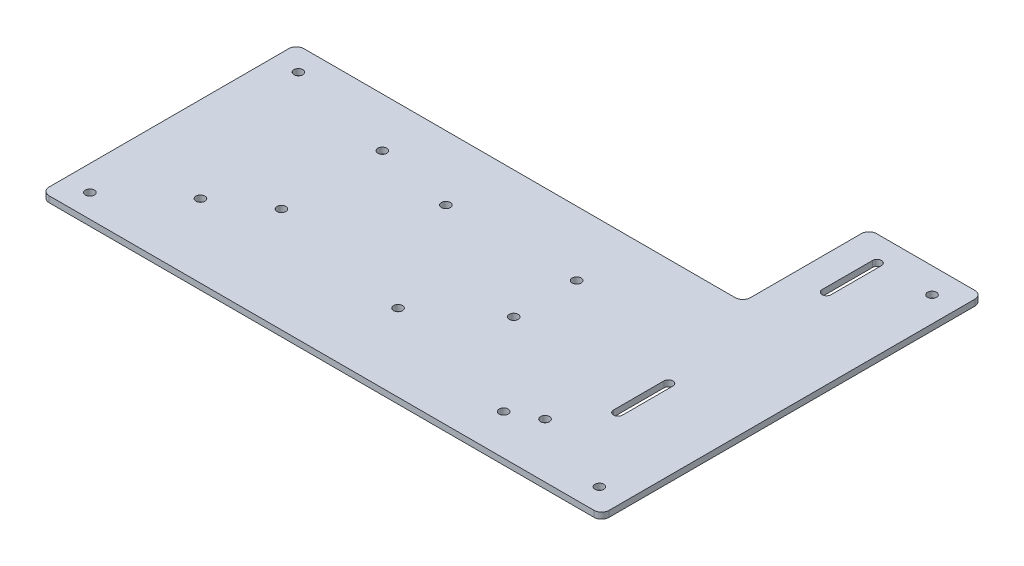
ISO-10303-21;
HEADER;
FILE_DESCRIPTION(('STEP AP214'),'2;1');
FILE_NAME('part.step','',(''),(''),'','','');
FILE_SCHEMA(('AUTOMOTIVE_DESIGN { 1 0 10303 214 1 1 1 1 }'));
ENDSEC;
DATA;
#1=APPLICATION_CONTEXT('core data for automotive mechanical design processes');
#2=APPLICATION_PROTOCOL_DEFINITION('international standard','automotive_design',2000,#1);
#3=PRODUCT_CONTEXT('',#1,'mechanical');
#4=PRODUCT('Part','Part','',(#3));
#5=PRODUCT_RELATED_PRODUCT_CATEGORY('part','',(#4));
#6=PRODUCT_DEFINITION_FORMATION('','',#4);
#7=PRODUCT_DEFINITION_CONTEXT('part definition',#1,'design');
#8=PRODUCT_DEFINITION('design','',#6,#7);
#9=PRODUCT_DEFINITION_SHAPE('','',#8);
#10=(LENGTH_UNIT() NAMED_UNIT(*) SI_UNIT(.MILLI.,.METRE.));
#11=(NAMED_UNIT(*) PLANE_ANGLE_UNIT() SI_UNIT($,.RADIAN.));
#12=(NAMED_UNIT(*) SI_UNIT($,.STERADIAN.) SOLID_ANGLE_UNIT());
#13=UNCERTAINTY_MEASURE_WITH_UNIT(LENGTH_MEASURE(1.E-05),#10,'distance_accuracy_value','');
#14=(GEOMETRIC_REPRESENTATION_CONTEXT(3) GLOBAL_UNCERTAINTY_ASSIGNED_CONTEXT((#13)) GLOBAL_UNIT_ASSIGNED_CONTEXT((#10,
#11,#12)) REPRESENTATION_CONTEXT('',''));
#15=CARTESIAN_POINT('',(0.,0.,0.));
#16=DIRECTION('',(0.,0.,1.));
#17=DIRECTION('',(1.,0.,0.));
#18=AXIS2_PLACEMENT_3D('',#15,#16,#17);
#19=CARTESIAN_POINT('',(0.,0.,0.));
#20=DIRECTION('',(0.,-1.,0.));
#21=DIRECTION('',(0.,0.,-1.));
#22=AXIS2_PLACEMENT_3D('',#19,#20,#21);
#23=PLANE('',#22);
#24=CARTESIAN_POINT('',(241.554,0.,-48.67));
#25=DIRECTION('',(0.,1.,0.));
#26=DIRECTION('',(0.,0.,-1.));
#27=AXIS2_PLACEMENT_3D('',#24,#25,#26);
#28=CIRCLE('',#27,2.2479);
#29=CARTESIAN_POINT('',(239.3061,0.,-48.67));
#30=VERTEX_POINT('',#29);
#31=CARTESIAN_POINT('',(243.8019,0.,-48.67));
#32=VERTEX_POINT('',#31);
#33=EDGE_CURVE('E171',#30,#32,#28,.T.);
#34=ORIENTED_EDGE('',*,*,#33,.T.);
#35=DIRECTION('',(0.,0.,-1.));
#36=VECTOR('',#35,1.);
#37=CARTESIAN_POINT('',(243.8019,0.,-48.67));
#38=LINE('',#37,#36);
#39=CARTESIAN_POINT('',(243.8019,0.,-74.07));
#40=VERTEX_POINT('',#39);
#41=EDGE_CURVE('E180',#32,#40,#38,.T.);
#42=ORIENTED_EDGE('',*,*,#41,.T.);
#43=CARTESIAN_POINT('',(241.554,0.,-74.07));
#44=DIRECTION('',(0.,1.,0.));
#45=DIRECTION('',(0.,0.,-1.));
#46=AXIS2_PLACEMENT_3D('',#43,#44,#45);
#47=CIRCLE('',#46,2.2479);
#48=CARTESIAN_POINT('',(239.3061,0.,-74.07));
#49=VERTEX_POINT('',#48);
#50=EDGE_CURVE('E48',#40,#49,#47,.T.);
#51=ORIENTED_EDGE('',*,*,#50,.T.);
#52=DIRECTION('',(0.,0.,1.));
#53=VECTOR('',#52,1.);
#54=CARTESIAN_POINT('',(239.3061,0.,-48.67));
#55=LINE('',#54,#53);
#56=EDGE_CURVE('E177',#49,#30,#55,.T.);
#57=ORIENTED_EDGE('',*,*,#56,.T.);
#58=EDGE_LOOP('',(#34,#42,#51,#57));
#59=FACE_BOUND('',#58,.T.);
#60=CARTESIAN_POINT('',(241.554,0.,-179.07));
#61=DIRECTION('',(0.,1.,0.));
#62=DIRECTION('',(0.,0.,1.));
#63=AXIS2_PLACEMENT_3D('',#60,#61,#62);
#64=CIRCLE('',#63,2.2479);
#65=CARTESIAN_POINT('',(243.8019,0.,-179.07));
#66=VERTEX_POINT('',#65);
#67=CARTESIAN_POINT('',(239.3061,0.,-179.07));
#68=VERTEX_POINT('',#67);
#69=EDGE_CURVE('E205',#66,#68,#64,.T.);
#70=ORIENTED_EDGE('',*,*,#69,.T.);
#71=DIRECTION('',(0.,0.,1.));
#72=VECTOR('',#71,1.);
#73=CARTESIAN_POINT('',(239.3061,0.,-179.07));
#74=LINE('',#73,#72);
#75=CARTESIAN_POINT('',(239.3061,0.,-153.67));
#76=VERTEX_POINT('',#75);
#77=EDGE_CURVE('E208',#68,#76,#74,.T.);
#78=ORIENTED_EDGE('',*,*,#77,.T.);
#79=CARTESIAN_POINT('',(241.554,0.,-153.67));
#80=DIRECTION('',(0.,1.,0.));
#81=DIRECTION('',(0.,0.,1.));
#82=AXIS2_PLACEMENT_3D('',#79,#80,#81);
#83=CIRCLE('',#82,2.2479);
#84=CARTESIAN_POINT('',(243.8019,0.,-153.67));
#85=VERTEX_POINT('',#84);
#86=EDGE_CURVE('E212',#76,#85,#83,.T.);
#87=ORIENTED_EDGE('',*,*,#86,.T.);
#88=DIRECTION('',(0.,0.,-1.));
#89=VECTOR('',#88,1.);
#90=CARTESIAN_POINT('',(243.8019,0.,-179.07));
#91=LINE('',#90,#89);
#92=EDGE_CURVE('E215',#85,#66,#91,.T.);
#93=ORIENTED_EDGE('',*,*,#92,.T.);
#94=EDGE_LOOP('',(#70,#78,#87,#93));
#95=FACE_BOUND('',#94,.T.);
#96=CARTESIAN_POINT('',(12.7,0.,-11.635));
#97=DIRECTION('',(0.,1.,0.));
#98=DIRECTION('',(0.,0.,1.));
#99=AXIS2_PLACEMENT_3D('',#96,#97,#98);
#100=CIRCLE('',#99,2.2479);
#101=CARTESIAN_POINT('',(12.7,0.,-9.3871));
#102=VERTEX_POINT('',#101);
#103=EDGE_CURVE('E239',#102,#102,#100,.T.);
#104=ORIENTED_EDGE('',*,*,#103,.T.);
#105=EDGE_LOOP('',(#104));
#106=FACE_BOUND('',#105,.T.);
#107=CARTESIAN_POINT('',(269.24,0.,-11.635));
#108=DIRECTION('',(0.,1.,0.));
#109=DIRECTION('',(0.,0.,1.));
#110=AXIS2_PLACEMENT_3D('',#107,#108,#109);
#111=CIRCLE('',#110,2.24790000000002);
#112=CARTESIAN_POINT('',(269.24,0.,-9.38709999999998));
#113=VERTEX_POINT('',#112);
#114=EDGE_CURVE('E245',#113,#113,#111,.T.);
#115=ORIENTED_EDGE('',*,*,#114,.T.);
#116=EDGE_LOOP('',(#115));
#117=FACE_BOUND('',#116,.T.);
#118=CARTESIAN_POINT('',(269.24,0.,-179.07));
#119=DIRECTION('',(0.,1.,0.));
#120=DIRECTION('',(0.,0.,1.));
#121=AXIS2_PLACEMENT_3D('',#118,#119,#120);
#122=CIRCLE('',#121,2.24790000000002);
#123=CARTESIAN_POINT('',(269.24,0.,-176.8221));
#124=VERTEX_POINT('',#123);
#125=EDGE_CURVE('E251',#124,#124,#122,.T.);
#126=ORIENTED_EDGE('',*,*,#125,.T.);
#127=EDGE_LOOP('',(#126));
#128=FACE_BOUND('',#127,.T.);
#129=CARTESIAN_POINT('',(12.7,0.,-116.635));
#130=DIRECTION('',(0.,1.,0.));
#131=DIRECTION('',(0.,0.,1.));
#132=AXIS2_PLACEMENT_3D('',#129,#130,#131);
#133=CIRCLE('',#132,2.2479);
#134=CARTESIAN_POINT('',(12.7,0.,-114.3871));
#135=VERTEX_POINT('',#134);
#136=EDGE_CURVE('E257',#135,#135,#133,.T.);
#137=ORIENTED_EDGE('',*,*,#136,.T.);
#138=EDGE_LOOP('',(#137));
#139=FACE_BOUND('',#138,.T.);
#140=DIRECTION('',(-1.,0.,0.));
#141=VECTOR('',#140,1.);
#142=CARTESIAN_POINT('',(281.94,0.,-191.77));
#143=LINE('',#142,#141);
#144=CARTESIAN_POINT('',(278.13,0.,-191.77));
#145=VERTEX_POINT('',#144);
#146=CARTESIAN_POINT('',(228.6,0.,-191.77));
#147=VERTEX_POINT('',#146);
#148=EDGE_CURVE('E343',#145,#147,#143,.T.);
#149=ORIENTED_EDGE('',*,*,#148,.F.);
#150=CARTESIAN_POINT('',(278.13,0.,-187.96));
#151=DIRECTION('',(0.,-1.,0.));
#152=DIRECTION('',(0.,0.,-1.));
#153=AXIS2_PLACEMENT_3D('',#150,#151,#152);
#154=CIRCLE('',#153,3.81);
#155=CARTESIAN_POINT('',(281.94,0.,-187.96));
#156=VERTEX_POINT('',#155);
#157=EDGE_CURVE('E363',#145,#156,#154,.T.);
#158=ORIENTED_EDGE('',*,*,#157,.T.);
#159=DIRECTION('',(0.,0.,-1.));
#160=VECTOR('',#159,1.);
#161=CARTESIAN_POINT('',(281.94,0.,0.));
#162=LINE('',#161,#160);
#163=CARTESIAN_POINT('',(281.94,0.,-3.81));
#164=VERTEX_POINT('',#163);
#165=EDGE_CURVE('E340',#164,#156,#162,.T.);
#166=ORIENTED_EDGE('',*,*,#165,.F.);
#167=CARTESIAN_POINT('',(278.13,0.,-3.81));
#168=DIRECTION('',(0.,-1.,0.));
#169=DIRECTION('',(0.,0.,-1.));
#170=AXIS2_PLACEMENT_3D('',#167,#168,#169);
#171=CIRCLE('',#170,3.81);
#172=CARTESIAN_POINT('',(278.13,0.,0.));
#173=VERTEX_POINT('',#172);
#174=EDGE_CURVE('E359',#164,#173,#171,.T.);
#175=ORIENTED_EDGE('',*,*,#174,.T.);
#176=DIRECTION('',(1.,0.,0.));
#177=VECTOR('',#176,1.);
#178=CARTESIAN_POINT('',(0.,0.,0.));
#179=LINE('',#178,#177);
#180=CARTESIAN_POINT('',(3.81,0.,0.));
#181=VERTEX_POINT('',#180);
#182=EDGE_CURVE('E337',#181,#173,#179,.T.);
#183=ORIENTED_EDGE('',*,*,#182,.F.);
#184=CARTESIAN_POINT('',(3.81,0.,-3.81));
#185=DIRECTION('',(0.,-1.,0.));
#186=DIRECTION('',(0.,0.,-1.));
#187=AXIS2_PLACEMENT_3D('',#184,#185,#186);
#188=CIRCLE('',#187,3.81);
#189=CARTESIAN_POINT('',(0.,0.,-3.81));
#190=VERTEX_POINT('',#189);
#191=EDGE_CURVE('E355',#181,#190,#188,.T.);
#192=ORIENTED_EDGE('',*,*,#191,.T.);
#193=DIRECTION('',(0.,0.,1.));
#194=VECTOR('',#193,1.);
#195=CARTESIAN_POINT('',(0.,0.,0.));
#196=LINE('',#195,#194);
#197=CARTESIAN_POINT('',(0.,0.,-124.46));
#198=VERTEX_POINT('',#197);
#199=EDGE_CURVE('E314',#198,#190,#196,.T.);
#200=ORIENTED_EDGE('',*,*,#199,.F.);
#201=CARTESIAN_POINT('',(3.81,0.,-124.46));
#202=DIRECTION('',(0.,-1.,0.));
#203=DIRECTION('',(0.,0.,-1.));
#204=AXIS2_PLACEMENT_3D('',#201,#202,#203);
#205=CIRCLE('',#204,3.81);
#206=CARTESIAN_POINT('',(3.81,0.,-128.27));
#207=VERTEX_POINT('',#206);
#208=EDGE_CURVE('E357',#198,#207,#205,.T.);
#209=ORIENTED_EDGE('',*,*,#208,.T.);
#210=DIRECTION('',(-1.,0.,0.));
#211=VECTOR('',#210,1.);
#212=CARTESIAN_POINT('',(0.,0.,-128.27));
#213=LINE('',#212,#211);
#214=CARTESIAN_POINT('',(220.98,0.,-128.27));
#215=VERTEX_POINT('',#214);
#216=EDGE_CURVE('E319',#215,#207,#213,.T.);
#217=ORIENTED_EDGE('',*,*,#216,.F.);
#218=CARTESIAN_POINT('',(220.98,0.,-132.08));
#219=DIRECTION('',(0.,-1.,0.));
#220=DIRECTION('',(0.,0.,-1.));
#221=AXIS2_PLACEMENT_3D('',#218,#219,#220);
#222=CIRCLE('',#221,3.81);
#223=CARTESIAN_POINT('',(224.79,0.,-132.08));
#224=VERTEX_POINT('',#223);
#225=EDGE_CURVE('E41',#215,#224,#222,.F.);
#226=ORIENTED_EDGE('',*,*,#225,.T.);
#227=DIRECTION('',(0.,0.,1.));
#228=VECTOR('',#227,1.);
#229=CARTESIAN_POINT('',(224.79,0.,-191.77));
#230=LINE('',#229,#228);
#231=CARTESIAN_POINT('',(224.79,0.,-187.96));
#232=VERTEX_POINT('',#231);
#233=EDGE_CURVE('E346',#232,#224,#230,.T.);
#234=ORIENTED_EDGE('',*,*,#233,.F.);
#235=CARTESIAN_POINT('',(228.6,0.,-187.96));
#236=DIRECTION('',(0.,-1.,0.));
#237=DIRECTION('',(0.,0.,-1.));
#238=AXIS2_PLACEMENT_3D('',#235,#236,#237);
#239=CIRCLE('',#238,3.81);
#240=EDGE_CURVE('E361',#232,#147,#239,.T.);
#241=ORIENTED_EDGE('',*,*,#240,.T.);
#242=EDGE_LOOP('',(#149,#158,#166,#175,#183,#192,#200,#209,#217,#226,#234,#241));
#243=FACE_BOUND('',#242,.T.);
#244=CARTESIAN_POINT('',(173.561465343809,0.,-95.8350000000001));
#245=DIRECTION('',(0.,1.,0.));
#246=DIRECTION('',(0.,0.,1.));
#247=AXIS2_PLACEMENT_3D('',#244,#245,#246);
#248=CIRCLE('',#247,2.2479);
#249=CARTESIAN_POINT('',(173.561465343809,0.,-93.5871000000001));
#250=VERTEX_POINT('',#249);
#251=EDGE_CURVE('E311',#250,#250,#248,.T.);
#252=ORIENTED_EDGE('',*,*,#251,.T.);
#253=EDGE_LOOP('',(#252));
#254=FACE_BOUND('',#253,.T.);
#255=CARTESIAN_POINT('',(107.743534656191,0.,-95.8349999999998));
#256=DIRECTION('',(0.,1.,0.));
#257=DIRECTION('',(0.,0.,1.));
#258=AXIS2_PLACEMENT_3D('',#255,#256,#257);
#259=CIRCLE('',#258,2.2479);
#260=CARTESIAN_POINT('',(107.743534656191,0.,-93.5870999999998));
#261=VERTEX_POINT('',#260);
#262=EDGE_CURVE('E305',#261,#261,#259,.T.);
#263=ORIENTED_EDGE('',*,*,#262,.T.);
#264=EDGE_LOOP('',(#263));
#265=FACE_BOUND('',#264,.T.);
#266=CARTESIAN_POINT('',(140.6525,0.,-38.835));
#267=DIRECTION('',(0.,1.,0.));
#268=DIRECTION('',(0.,0.,1.));
#269=AXIS2_PLACEMENT_3D('',#266,#267,#268);
#270=CIRCLE('',#269,2.2479);
#271=CARTESIAN_POINT('',(140.6525,0.,-36.5871));
#272=VERTEX_POINT('',#271);
#273=EDGE_CURVE('E299',#272,#272,#270,.T.);
#274=ORIENTED_EDGE('',*,*,#273,.T.);
#275=EDGE_LOOP('',(#274));
#276=FACE_BOUND('',#275,.T.);
#277=CARTESIAN_POINT('',(226.06,0.,-27.432));
#278=DIRECTION('',(0.,1.,0.));
#279=DIRECTION('',(0.,0.,1.));
#280=AXIS2_PLACEMENT_3D('',#277,#278,#279);
#281=CIRCLE('',#280,2.2479);
#282=CARTESIAN_POINT('',(226.06,0.,-25.1841));
#283=VERTEX_POINT('',#282);
#284=EDGE_CURVE('E293',#283,#283,#281,.T.);
#285=ORIENTED_EDGE('',*,*,#284,.T.);
#286=EDGE_LOOP('',(#285));
#287=FACE_BOUND('',#286,.T.);
#288=CARTESIAN_POINT('',(43.18,0.,-36.83));
#289=DIRECTION('',(0.,1.,0.));
#290=DIRECTION('',(0.,0.,1.));
#291=AXIS2_PLACEMENT_3D('',#288,#289,#290);
#292=CIRCLE('',#291,2.2479);
#293=CARTESIAN_POINT('',(43.18,0.,-34.5821));
#294=VERTEX_POINT('',#293);
#295=EDGE_CURVE('E287',#294,#294,#292,.T.);
#296=ORIENTED_EDGE('',*,*,#295,.T.);
#297=EDGE_LOOP('',(#296));
#298=FACE_BOUND('',#297,.T.);
#299=CARTESIAN_POINT('',(68.072,0.,-52.705));
#300=DIRECTION('',(0.,1.,0.));
#301=DIRECTION('',(0.,0.,1.));
#302=AXIS2_PLACEMENT_3D('',#299,#300,#301);
#303=CIRCLE('',#302,2.2479);
#304=CARTESIAN_POINT('',(68.072,0.,-50.4571));
#305=VERTEX_POINT('',#304);
#306=EDGE_CURVE('E281',#305,#305,#303,.T.);
#307=ORIENTED_EDGE('',*,*,#306,.T.);
#308=EDGE_LOOP('',(#307));
#309=FACE_BOUND('',#308,.T.);
#310=CARTESIAN_POINT('',(68.072,0.,-103.505));
#311=DIRECTION('',(0.,1.,0.));
#312=DIRECTION('',(0.,0.,1.));
#313=AXIS2_PLACEMENT_3D('',#310,#311,#312);
#314=CIRCLE('',#313,2.2479);
#315=CARTESIAN_POINT('',(68.072,0.,-101.2571));
#316=VERTEX_POINT('',#315);
#317=EDGE_CURVE('E275',#316,#316,#314,.T.);
#318=ORIENTED_EDGE('',*,*,#317,.T.);
#319=EDGE_LOOP('',(#318));
#320=FACE_BOUND('',#319,.T.);
#321=CARTESIAN_POINT('',(212.344,0.,-20.32));
#322=DIRECTION('',(0.,1.,0.));
#323=DIRECTION('',(0.,0.,1.));
#324=AXIS2_PLACEMENT_3D('',#321,#322,#323);
#325=CIRCLE('',#324,2.2479);
#326=CARTESIAN_POINT('',(212.344,0.,-18.0721));
#327=VERTEX_POINT('',#326);
#328=EDGE_CURVE('E269',#327,#327,#325,.T.);
#329=ORIENTED_EDGE('',*,*,#328,.T.);
#330=EDGE_LOOP('',(#329));
#331=FACE_BOUND('',#330,.T.);
#332=CARTESIAN_POINT('',(173.561465343809,0.,-64.135));
#333=DIRECTION('',(0.,1.,0.));
#334=DIRECTION('',(0.,0.,1.));
#335=AXIS2_PLACEMENT_3D('',#332,#333,#334);
#336=CIRCLE('',#335,2.2479);
#337=CARTESIAN_POINT('',(173.561465343809,0.,-61.8871));
#338=VERTEX_POINT('',#337);
#339=EDGE_CURVE('E263',#338,#338,#336,.T.);
#340=ORIENTED_EDGE('',*,*,#339,.T.);
#341=EDGE_LOOP('',(#340));
#342=FACE_BOUND('',#341,.T.);
#343=ADVANCED_FACE('F33',(#59,#95,#106,#117,#128,#139,#243,#254,#265,#276,#287,#298,#309,#320,
#331,#342),#23,.T.);
#344=CARTESIAN_POINT('',(0.,3.0734,0.));
#345=DIRECTION('',(1.,0.,0.));
#346=DIRECTION('',(0.,0.,-1.));
#347=AXIS2_PLACEMENT_3D('',#344,#345,#346);
#348=PLANE('',#347);
#349=DIRECTION('',(0.,0.,1.));
#350=VECTOR('',#349,1.);
#351=CARTESIAN_POINT('',(0.,3.0734,0.));
#352=LINE('',#351,#350);
#353=CARTESIAN_POINT('',(0.,3.0734,-124.46));
#354=VERTEX_POINT('',#353);
#355=CARTESIAN_POINT('',(0.,3.0734,-3.81));
#356=VERTEX_POINT('',#355);
#357=EDGE_CURVE('E315',#354,#356,#352,.T.);
#358=ORIENTED_EDGE('',*,*,#357,.F.);
#359=DIRECTION('',(0.,-1.,0.));
#360=VECTOR('',#359,1.);
#361=CARTESIAN_POINT('',(0.,3.0734,-124.46));
#362=LINE('',#361,#360);
#363=EDGE_CURVE('E397',#354,#198,#362,.T.);
#364=ORIENTED_EDGE('',*,*,#363,.T.);
#365=ORIENTED_EDGE('',*,*,#199,.T.);
#366=DIRECTION('',(0.,-1.,0.));
#367=VECTOR('',#366,1.);
#368=CARTESIAN_POINT('',(0.,3.0734,-3.81));
#369=LINE('',#368,#367);
#370=EDGE_CURVE('E395',#190,#356,#369,.F.);
#371=ORIENTED_EDGE('',*,*,#370,.T.);
#372=EDGE_LOOP('',(#358,#364,#365,#371));
#373=FACE_BOUND('',#372,.T.);
#374=ADVANCED_FACE('F426',(#373),#348,.F.);
#375=CARTESIAN_POINT('',(0.,3.0734,0.));
#376=DIRECTION('',(0.,0.,-1.));
#377=DIRECTION('',(-1.,0.,0.));
#378=AXIS2_PLACEMENT_3D('',#375,#376,#377);
#379=PLANE('',#378);
#380=ORIENTED_EDGE('',*,*,#182,.T.);
#381=DIRECTION('',(0.,-1.,0.));
#382=VECTOR('',#381,1.);
#383=CARTESIAN_POINT('',(278.13,3.0734,0.));
#384=LINE('',#383,#382);
#385=CARTESIAN_POINT('',(278.13,3.0734,0.));
#386=VERTEX_POINT('',#385);
#387=EDGE_CURVE('E393',#173,#386,#384,.F.);
#388=ORIENTED_EDGE('',*,*,#387,.T.);
#389=DIRECTION('',(1.,0.,0.));
#390=VECTOR('',#389,1.);
#391=CARTESIAN_POINT('',(0.,3.0734,0.));
#392=LINE('',#391,#390);
#393=CARTESIAN_POINT('',(3.81,3.0734,0.));
#394=VERTEX_POINT('',#393);
#395=EDGE_CURVE('E318',#394,#386,#392,.T.);
#396=ORIENTED_EDGE('',*,*,#395,.F.);
#397=DIRECTION('',(0.,-1.,0.));
#398=VECTOR('',#397,1.);
#399=CARTESIAN_POINT('',(3.81,3.0734,0.));
#400=LINE('',#399,#398);
#401=EDGE_CURVE('E390',#394,#181,#400,.T.);
#402=ORIENTED_EDGE('',*,*,#401,.T.);
#403=EDGE_LOOP('',(#380,#388,#396,#402));
#404=FACE_BOUND('',#403,.T.);
#405=ADVANCED_FACE('F434',(#404),#379,.F.);
#406=CARTESIAN_POINT('',(281.94,3.0734,0.));
#407=DIRECTION('',(-1.,0.,0.));
#408=DIRECTION('',(0.,0.,1.));
#409=AXIS2_PLACEMENT_3D('',#406,#407,#408);
#410=PLANE('',#409);
#411=ORIENTED_EDGE('',*,*,#165,.T.);
#412=DIRECTION('',(0.,-1.,0.));
#413=VECTOR('',#412,1.);
#414=CARTESIAN_POINT('',(281.94,3.0734,-187.96));
#415=LINE('',#414,#413);
#416=CARTESIAN_POINT('',(281.94,3.0734,-187.96));
#417=VERTEX_POINT('',#416);
#418=EDGE_CURVE('E368',#156,#417,#415,.F.);
#419=ORIENTED_EDGE('',*,*,#418,.T.);
#420=DIRECTION('',(0.,0.,-1.));
#421=VECTOR('',#420,1.);
#422=CARTESIAN_POINT('',(281.94,3.0734,0.));
#423=LINE('',#422,#421);
#424=CARTESIAN_POINT('',(281.94,3.0734,-3.81));
#425=VERTEX_POINT('',#424);
#426=EDGE_CURVE('E322',#425,#417,#423,.T.);
#427=ORIENTED_EDGE('',*,*,#426,.F.);
#428=DIRECTION('',(0.,-1.,0.));
#429=VECTOR('',#428,1.);
#430=CARTESIAN_POINT('',(281.94,3.0734,-3.81));
#431=LINE('',#430,#429);
#432=EDGE_CURVE('E365',#425,#164,#431,.T.);
#433=ORIENTED_EDGE('',*,*,#432,.T.);
#434=EDGE_LOOP('',(#411,#419,#427,#433));
#435=FACE_BOUND('',#434,.T.);
#436=ADVANCED_FACE('F443',(#435),#410,.F.);
#437=CARTESIAN_POINT('',(281.94,3.0734,-191.77));
#438=DIRECTION('',(0.,0.,1.));
#439=DIRECTION('',(1.,0.,0.));
#440=AXIS2_PLACEMENT_3D('',#437,#438,#439);
#441=PLANE('',#440);
#442=DIRECTION('',(-1.,0.,0.));
#443=VECTOR('',#442,1.);
#444=CARTESIAN_POINT('',(281.94,3.0734,-191.77));
#445=LINE('',#444,#443);
#446=CARTESIAN_POINT('',(278.13,3.0734,-191.77));
#447=VERTEX_POINT('',#446);
#448=CARTESIAN_POINT('',(228.6,3.0734,-191.77));
#449=VERTEX_POINT('',#448);
#450=EDGE_CURVE('E325',#447,#449,#445,.T.);
#451=ORIENTED_EDGE('',*,*,#450,.F.);
#452=DIRECTION('',(0.,-1.,0.));
#453=VECTOR('',#452,1.);
#454=CARTESIAN_POINT('',(278.13,3.0734,-191.77));
#455=LINE('',#454,#453);
#456=EDGE_CURVE('E352',#447,#145,#455,.T.);
#457=ORIENTED_EDGE('',*,*,#456,.T.);
#458=ORIENTED_EDGE('',*,*,#148,.T.);
#459=DIRECTION('',(0.,-1.,0.));
#460=VECTOR('',#459,1.);
#461=CARTESIAN_POINT('',(228.6,3.0734,-191.77));
#462=LINE('',#461,#460);
#463=EDGE_CURVE('E334',#147,#449,#462,.F.);
#464=ORIENTED_EDGE('',*,*,#463,.T.);
#465=EDGE_LOOP('',(#451,#457,#458,#464));
#466=FACE_BOUND('',#465,.T.);
#467=ADVANCED_FACE('F452',(#466),#441,.F.);
#468=CARTESIAN_POINT('',(224.79,3.0734,-191.77));
#469=DIRECTION('',(1.,0.,0.));
#470=DIRECTION('',(0.,0.,-1.));
#471=AXIS2_PLACEMENT_3D('',#468,#469,#470);
#472=PLANE('',#471);
#473=DIRECTION('',(0.,0.,1.));
#474=VECTOR('',#473,1.);
#475=CARTESIAN_POINT('',(224.79,3.0734,-191.77));
#476=LINE('',#475,#474);
#477=CARTESIAN_POINT('',(224.79,3.0734,-187.96));
#478=VERTEX_POINT('',#477);
#479=CARTESIAN_POINT('',(224.79,3.0734,-132.08));
#480=VERTEX_POINT('',#479);
#481=EDGE_CURVE('E328',#478,#480,#476,.T.);
#482=ORIENTED_EDGE('',*,*,#481,.F.);
#483=DIRECTION('',(0.,-1.,0.));
#484=VECTOR('',#483,1.);
#485=CARTESIAN_POINT('',(224.79,3.0734,-187.96));
#486=LINE('',#485,#484);
#487=EDGE_CURVE('E382',#478,#232,#486,.T.);
#488=ORIENTED_EDGE('',*,*,#487,.T.);
#489=ORIENTED_EDGE('',*,*,#233,.T.);
#490=DIRECTION('',(0.,-1.,0.));
#491=VECTOR('',#490,1.);
#492=CARTESIAN_POINT('',(224.79,3.0734,-132.08));
#493=LINE('',#492,#491);
#494=EDGE_CURVE('E380',#224,#480,#493,.F.);
#495=ORIENTED_EDGE('',*,*,#494,.T.);
#496=EDGE_LOOP('',(#482,#488,#489,#495));
#497=FACE_BOUND('',#496,.T.);
#498=ADVANCED_FACE('F409',(#497),#472,.F.);
#499=CARTESIAN_POINT('',(0.,3.0734,-128.27));
#500=DIRECTION('',(0.,0.,1.));
#501=DIRECTION('',(1.,0.,0.));
#502=AXIS2_PLACEMENT_3D('',#499,#500,#501);
#503=PLANE('',#502);
#504=DIRECTION('',(-1.,0.,0.));
#505=VECTOR('',#504,1.);
#506=CARTESIAN_POINT('',(0.,3.0734,-128.27));
#507=LINE('',#506,#505);
#508=CARTESIAN_POINT('',(220.98,3.0734,-128.27));
#509=VERTEX_POINT('',#508);
#510=CARTESIAN_POINT('',(3.81,3.0734,-128.27));
#511=VERTEX_POINT('',#510);
#512=EDGE_CURVE('E331',#509,#511,#507,.T.);
#513=ORIENTED_EDGE('',*,*,#512,.F.);
#514=DIRECTION('',(0.,-1.,0.));
#515=VECTOR('',#514,1.);
#516=CARTESIAN_POINT('',(220.98,0.,-128.27));
#517=LINE('',#516,#515);
#518=EDGE_CURVE('E387',#509,#215,#517,.T.);
#519=ORIENTED_EDGE('',*,*,#518,.T.);
#520=ORIENTED_EDGE('',*,*,#216,.T.);
#521=DIRECTION('',(0.,-1.,0.));
#522=VECTOR('',#521,1.);
#523=CARTESIAN_POINT('',(3.81,3.0734,-128.27));
#524=LINE('',#523,#522);
#525=EDGE_CURVE('E385',#207,#511,#524,.F.);
#526=ORIENTED_EDGE('',*,*,#525,.T.);
#527=EDGE_LOOP('',(#513,#519,#520,#526));
#528=FACE_BOUND('',#527,.T.);
#529=ADVANCED_FACE('F418',(#528),#503,.F.);
#530=CARTESIAN_POINT('',(0.,3.0734,0.));
#531=DIRECTION('',(0.,-1.,0.));
#532=DIRECTION('',(0.,0.,-1.));
#533=AXIS2_PLACEMENT_3D('',#530,#531,#532);
#534=PLANE('',#533);
#535=DIRECTION('',(0.,0.,-1.));
#536=VECTOR('',#535,1.);
#537=CARTESIAN_POINT('',(243.8019,3.0734,-48.67));
#538=LINE('',#537,#536);
#539=CARTESIAN_POINT('',(243.8019,3.0734,-48.67));
#540=VERTEX_POINT('',#539);
#541=CARTESIAN_POINT('',(243.8019,3.0734,-74.07));
#542=VERTEX_POINT('',#541);
#543=EDGE_CURVE('E195',#540,#542,#538,.T.);
#544=ORIENTED_EDGE('',*,*,#543,.F.);
#545=CARTESIAN_POINT('',(241.554,3.0734,-48.67));
#546=DIRECTION('',(0.,1.,0.));
#547=DIRECTION('',(0.,0.,-1.));
#548=AXIS2_PLACEMENT_3D('',#545,#546,#547);
#549=CIRCLE('',#548,2.2479);
#550=CARTESIAN_POINT('',(239.3061,3.0734,-48.67));
#551=VERTEX_POINT('',#550);
#552=EDGE_CURVE('E56',#551,#540,#549,.T.);
#553=ORIENTED_EDGE('',*,*,#552,.F.);
#554=DIRECTION('',(0.,0.,1.));
#555=VECTOR('',#554,1.);
#556=CARTESIAN_POINT('',(239.3061,3.0734,-48.67));
#557=LINE('',#556,#555);
#558=CARTESIAN_POINT('',(239.3061,3.0734,-74.07));
#559=VERTEX_POINT('',#558);
#560=EDGE_CURVE('E186',#559,#551,#557,.T.);
#561=ORIENTED_EDGE('',*,*,#560,.F.);
#562=CARTESIAN_POINT('',(241.554,3.0734,-74.07));
#563=DIRECTION('',(0.,1.,0.));
#564=DIRECTION('',(0.,0.,-1.));
#565=AXIS2_PLACEMENT_3D('',#562,#563,#564);
#566=CIRCLE('',#565,2.2479);
#567=EDGE_CURVE('E189',#542,#559,#566,.T.);
#568=ORIENTED_EDGE('',*,*,#567,.F.);
#569=EDGE_LOOP('',(#544,#553,#561,#568));
#570=FACE_BOUND('',#569,.T.);
#571=DIRECTION('',(0.,0.,1.));
#572=VECTOR('',#571,1.);
#573=CARTESIAN_POINT('',(239.3061,3.0734,-179.07));
#574=LINE('',#573,#572);
#575=CARTESIAN_POINT('',(239.3061,3.0734,-179.07));
#576=VERTEX_POINT('',#575);
#577=CARTESIAN_POINT('',(239.3061,3.0734,-153.67));
#578=VERTEX_POINT('',#577);
#579=EDGE_CURVE('E220',#576,#578,#574,.T.);
#580=ORIENTED_EDGE('',*,*,#579,.F.);
#581=CARTESIAN_POINT('',(241.554,3.0734,-179.07));
#582=DIRECTION('',(0.,1.,0.));
#583=DIRECTION('',(0.,0.,1.));
#584=AXIS2_PLACEMENT_3D('',#581,#582,#583);
#585=CIRCLE('',#584,2.2479);
#586=CARTESIAN_POINT('',(243.8019,3.0734,-179.07));
#587=VERTEX_POINT('',#586);
#588=EDGE_CURVE('E201',#587,#576,#585,.T.);
#589=ORIENTED_EDGE('',*,*,#588,.F.);
#590=DIRECTION('',(0.,0.,-1.));
#591=VECTOR('',#590,1.);
#592=CARTESIAN_POINT('',(243.8019,3.0734,-179.07));
#593=LINE('',#592,#591);
#594=CARTESIAN_POINT('',(243.8019,3.0734,-153.67));
#595=VERTEX_POINT('',#594);
#596=EDGE_CURVE('E209',#595,#587,#593,.T.);
#597=ORIENTED_EDGE('',*,*,#596,.F.);
#598=CARTESIAN_POINT('',(241.554,3.0734,-153.67));
#599=DIRECTION('',(0.,1.,0.));
#600=DIRECTION('',(0.,0.,1.));
#601=AXIS2_PLACEMENT_3D('',#598,#599,#600);
#602=CIRCLE('',#601,2.2479);
#603=EDGE_CURVE('E223',#578,#595,#602,.T.);
#604=ORIENTED_EDGE('',*,*,#603,.F.);
#605=EDGE_LOOP('',(#580,#589,#597,#604));
#606=FACE_BOUND('',#605,.T.);
#607=CARTESIAN_POINT('',(12.7,3.0734,-11.635));
#608=DIRECTION('',(0.,1.,0.));
#609=DIRECTION('',(0.,0.,1.));
#610=AXIS2_PLACEMENT_3D('',#607,#608,#609);
#611=CIRCLE('',#610,2.24789999999999);
#612=CARTESIAN_POINT('',(12.7,3.0734,-9.38710000000001));
#613=VERTEX_POINT('',#612);
#614=EDGE_CURVE('E230',#613,#613,#611,.T.);
#615=ORIENTED_EDGE('',*,*,#614,.F.);
#616=EDGE_LOOP('',(#615));
#617=FACE_BOUND('',#616,.T.);
#618=CARTESIAN_POINT('',(269.24,3.0734,-11.635));
#619=DIRECTION('',(0.,1.,0.));
#620=DIRECTION('',(0.,0.,1.));
#621=AXIS2_PLACEMENT_3D('',#618,#619,#620);
#622=CIRCLE('',#621,2.24789999999997);
#623=CARTESIAN_POINT('',(269.24,3.0734,-9.38710000000004));
#624=VERTEX_POINT('',#623);
#625=EDGE_CURVE('E242',#624,#624,#622,.T.);
#626=ORIENTED_EDGE('',*,*,#625,.F.);
#627=EDGE_LOOP('',(#626));
#628=FACE_BOUND('',#627,.T.);
#629=CARTESIAN_POINT('',(269.24,3.0734,-179.07));
#630=DIRECTION('',(0.,1.,0.));
#631=DIRECTION('',(0.,0.,1.));
#632=AXIS2_PLACEMENT_3D('',#629,#630,#631);
#633=CIRCLE('',#632,2.24789999999997);
#634=CARTESIAN_POINT('',(269.24,3.0734,-176.8221));
#635=VERTEX_POINT('',#634);
#636=EDGE_CURVE('E248',#635,#635,#633,.T.);
#637=ORIENTED_EDGE('',*,*,#636,.F.);
#638=EDGE_LOOP('',(#637));
#639=FACE_BOUND('',#638,.T.);
#640=CARTESIAN_POINT('',(12.7,3.0734,-116.635));
#641=DIRECTION('',(0.,1.,0.));
#642=DIRECTION('',(0.,0.,1.));
#643=AXIS2_PLACEMENT_3D('',#640,#641,#642);
#644=CIRCLE('',#643,2.24789999999999);
#645=CARTESIAN_POINT('',(12.7,3.0734,-114.3871));
#646=VERTEX_POINT('',#645);
#647=EDGE_CURVE('E254',#646,#646,#644,.T.);
#648=ORIENTED_EDGE('',*,*,#647,.F.);
#649=EDGE_LOOP('',(#648));
#650=FACE_BOUND('',#649,.T.);
#651=CARTESIAN_POINT('',(173.561465343809,3.0734,-64.135));
#652=DIRECTION('',(0.,1.,0.));
#653=DIRECTION('',(0.,0.,1.));
#654=AXIS2_PLACEMENT_3D('',#651,#652,#653);
#655=CIRCLE('',#654,2.2479);
#656=CARTESIAN_POINT('',(173.561465343809,3.0734,-61.8871));
#657=VERTEX_POINT('',#656);
#658=EDGE_CURVE('E260',#657,#657,#655,.T.);
#659=ORIENTED_EDGE('',*,*,#658,.F.);
#660=EDGE_LOOP('',(#659));
#661=FACE_BOUND('',#660,.T.);
#662=CARTESIAN_POINT('',(212.344,3.0734,-20.32));
#663=DIRECTION('',(0.,1.,0.));
#664=DIRECTION('',(0.,0.,1.));
#665=AXIS2_PLACEMENT_3D('',#662,#663,#664);
#666=CIRCLE('',#665,2.2479);
#667=CARTESIAN_POINT('',(212.344,3.0734,-18.0721));
#668=VERTEX_POINT('',#667);
#669=EDGE_CURVE('E266',#668,#668,#666,.T.);
#670=ORIENTED_EDGE('',*,*,#669,.F.);
#671=EDGE_LOOP('',(#670));
#672=FACE_BOUND('',#671,.T.);
#673=CARTESIAN_POINT('',(68.072,3.0734,-103.505));
#674=DIRECTION('',(0.,1.,0.));
#675=DIRECTION('',(0.,0.,1.));
#676=AXIS2_PLACEMENT_3D('',#673,#674,#675);
#677=CIRCLE('',#676,2.24789999999998);
#678=CARTESIAN_POINT('',(68.072,3.0734,-101.2571));
#679=VERTEX_POINT('',#678);
#680=EDGE_CURVE('E272',#679,#679,#677,.T.);
#681=ORIENTED_EDGE('',*,*,#680,.F.);
#682=EDGE_LOOP('',(#681));
#683=FACE_BOUND('',#682,.T.);
#684=CARTESIAN_POINT('',(68.072,3.0734,-52.705));
#685=DIRECTION('',(0.,1.,0.));
#686=DIRECTION('',(0.,0.,1.));
#687=AXIS2_PLACEMENT_3D('',#684,#685,#686);
#688=CIRCLE('',#687,2.24789999999998);
#689=CARTESIAN_POINT('',(68.072,3.0734,-50.4571));
#690=VERTEX_POINT('',#689);
#691=EDGE_CURVE('E278',#690,#690,#688,.T.);
#692=ORIENTED_EDGE('',*,*,#691,.F.);
#693=EDGE_LOOP('',(#692));
#694=FACE_BOUND('',#693,.T.);
#695=CARTESIAN_POINT('',(43.18,3.0734,-36.83));
#696=DIRECTION('',(0.,1.,0.));
#697=DIRECTION('',(0.,0.,1.));
#698=AXIS2_PLACEMENT_3D('',#695,#696,#697);
#699=CIRCLE('',#698,2.24789999999998);
#700=CARTESIAN_POINT('',(43.18,3.0734,-34.5821));
#701=VERTEX_POINT('',#700);
#702=EDGE_CURVE('E284',#701,#701,#699,.T.);
#703=ORIENTED_EDGE('',*,*,#702,.F.);
#704=EDGE_LOOP('',(#703));
#705=FACE_BOUND('',#704,.T.);
#706=CARTESIAN_POINT('',(226.06,3.0734,-27.432));
#707=DIRECTION('',(0.,1.,0.));
#708=DIRECTION('',(0.,0.,1.));
#709=AXIS2_PLACEMENT_3D('',#706,#707,#708);
#710=CIRCLE('',#709,2.2479);
#711=CARTESIAN_POINT('',(226.06,3.0734,-25.1841));
#712=VERTEX_POINT('',#711);
#713=EDGE_CURVE('E290',#712,#712,#710,.T.);
#714=ORIENTED_EDGE('',*,*,#713,.F.);
#715=EDGE_LOOP('',(#714));
#716=FACE_BOUND('',#715,.T.);
#717=CARTESIAN_POINT('',(140.6525,3.0734,-38.835));
#718=DIRECTION('',(0.,1.,0.));
#719=DIRECTION('',(0.,0.,1.));
#720=AXIS2_PLACEMENT_3D('',#717,#718,#719);
#721=CIRCLE('',#720,2.2479);
#722=CARTESIAN_POINT('',(140.6525,3.0734,-36.5871));
#723=VERTEX_POINT('',#722);
#724=EDGE_CURVE('E296',#723,#723,#721,.T.);
#725=ORIENTED_EDGE('',*,*,#724,.F.);
#726=EDGE_LOOP('',(#725));
#727=FACE_BOUND('',#726,.T.);
#728=CARTESIAN_POINT('',(107.743534656191,3.0734,-95.8349999999998));
#729=DIRECTION('',(0.,1.,0.));
#730=DIRECTION('',(0.,0.,1.));
#731=AXIS2_PLACEMENT_3D('',#728,#729,#730);
#732=CIRCLE('',#731,2.2479);
#733=CARTESIAN_POINT('',(107.743534656191,3.0734,-93.5870999999998));
#734=VERTEX_POINT('',#733);
#735=EDGE_CURVE('E302',#734,#734,#732,.T.);
#736=ORIENTED_EDGE('',*,*,#735,.F.);
#737=EDGE_LOOP('',(#736));
#738=FACE_BOUND('',#737,.T.);
#739=CARTESIAN_POINT('',(173.561465343809,3.0734,-95.8350000000001));
#740=DIRECTION('',(0.,1.,0.));
#741=DIRECTION('',(0.,0.,1.));
#742=AXIS2_PLACEMENT_3D('',#739,#740,#741);
#743=CIRCLE('',#742,2.2479);
#744=CARTESIAN_POINT('',(173.561465343809,3.0734,-93.5871000000001));
#745=VERTEX_POINT('',#744);
#746=EDGE_CURVE('E308',#745,#745,#743,.T.);
#747=ORIENTED_EDGE('',*,*,#746,.F.);
#748=EDGE_LOOP('',(#747));
#749=FACE_BOUND('',#748,.T.);
#750=ORIENTED_EDGE('',*,*,#426,.T.);
#751=CARTESIAN_POINT('',(278.13,3.0734,-187.96));
#752=DIRECTION('',(0.,-1.,0.));
#753=DIRECTION('',(0.,0.,-1.));
#754=AXIS2_PLACEMENT_3D('',#751,#752,#753);
#755=CIRCLE('',#754,3.81);
#756=EDGE_CURVE('E378',#417,#447,#755,.F.);
#757=ORIENTED_EDGE('',*,*,#756,.T.);
#758=ORIENTED_EDGE('',*,*,#450,.T.);
#759=CARTESIAN_POINT('',(228.6,3.0734,-187.96));
#760=DIRECTION('',(0.,-1.,0.));
#761=DIRECTION('',(0.,0.,-1.));
#762=AXIS2_PLACEMENT_3D('',#759,#760,#761);
#763=CIRCLE('',#762,3.81);
#764=EDGE_CURVE('E376',#449,#478,#763,.F.);
#765=ORIENTED_EDGE('',*,*,#764,.T.);
#766=ORIENTED_EDGE('',*,*,#481,.T.);
#767=CARTESIAN_POINT('',(220.98,3.0734,-132.08));
#768=DIRECTION('',(0.,-1.,0.));
#769=DIRECTION('',(0.,0.,-1.));
#770=AXIS2_PLACEMENT_3D('',#767,#768,#769);
#771=CIRCLE('',#770,3.81);
#772=EDGE_CURVE('E11',#480,#509,#771,.T.);
#773=ORIENTED_EDGE('',*,*,#772,.T.);
#774=ORIENTED_EDGE('',*,*,#512,.T.);
#775=CARTESIAN_POINT('',(3.81,3.0734,-124.46));
#776=DIRECTION('',(0.,-1.,0.));
#777=DIRECTION('',(0.,0.,-1.));
#778=AXIS2_PLACEMENT_3D('',#775,#776,#777);
#779=CIRCLE('',#778,3.81);
#780=EDGE_CURVE('E372',#511,#354,#779,.F.);
#781=ORIENTED_EDGE('',*,*,#780,.T.);
#782=ORIENTED_EDGE('',*,*,#357,.T.);
#783=CARTESIAN_POINT('',(3.81,3.0734,-3.81));
#784=DIRECTION('',(0.,-1.,0.));
#785=DIRECTION('',(0.,0.,-1.));
#786=AXIS2_PLACEMENT_3D('',#783,#784,#785);
#787=CIRCLE('',#786,3.81);
#788=EDGE_CURVE('E370',#356,#394,#787,.F.);
#789=ORIENTED_EDGE('',*,*,#788,.T.);
#790=ORIENTED_EDGE('',*,*,#395,.T.);
#791=CARTESIAN_POINT('',(278.13,3.0734,-3.81));
#792=DIRECTION('',(0.,-1.,0.));
#793=DIRECTION('',(0.,0.,-1.));
#794=AXIS2_PLACEMENT_3D('',#791,#792,#793);
#795=CIRCLE('',#794,3.81);
#796=EDGE_CURVE('E374',#386,#425,#795,.F.);
#797=ORIENTED_EDGE('',*,*,#796,.T.);
#798=EDGE_LOOP('',(#750,#757,#758,#765,#766,#773,#774,#781,#782,#789,#790,#797));
#799=FACE_BOUND('',#798,.T.);
#800=ADVANCED_FACE('F415',(#570,#606,#617,#628,#639,#650,#661,#672,#683,#694,#705,#716,#727,
#738,#749,#799),#534,.F.);
#801=CARTESIAN_POINT('',(173.561465343809,3.0734,-95.8350000000001));
#802=DIRECTION('',(0.,1.,0.));
#803=DIRECTION('',(0.,0.,1.));
#804=AXIS2_PLACEMENT_3D('',#801,#802,#803);
#805=CYLINDRICAL_SURFACE('',#804,2.2479);
#806=ORIENTED_EDGE('',*,*,#251,.F.);
#807=EDGE_LOOP('',(#806));
#808=FACE_BOUND('',#807,.T.);
#809=ORIENTED_EDGE('',*,*,#746,.T.);
#810=EDGE_LOOP('',(#809));
#811=FACE_BOUND('',#810,.T.);
#812=ADVANCED_FACE('F510',(#808,#811),#805,.F.);
#813=CARTESIAN_POINT('',(107.743534656191,3.0734,-95.8349999999998));
#814=DIRECTION('',(0.,1.,0.));
#815=DIRECTION('',(0.,0.,1.));
#816=AXIS2_PLACEMENT_3D('',#813,#814,#815);
#817=CYLINDRICAL_SURFACE('',#816,2.2479);
#818=ORIENTED_EDGE('',*,*,#262,.F.);
#819=EDGE_LOOP('',(#818));
#820=FACE_BOUND('',#819,.T.);
#821=ORIENTED_EDGE('',*,*,#735,.T.);
#822=EDGE_LOOP('',(#821));
#823=FACE_BOUND('',#822,.T.);
#824=ADVANCED_FACE('F518',(#820,#823),#817,.F.);
#825=CARTESIAN_POINT('',(140.6525,3.0734,-38.835));
#826=DIRECTION('',(0.,1.,0.));
#827=DIRECTION('',(0.,0.,1.));
#828=AXIS2_PLACEMENT_3D('',#825,#826,#827);
#829=CYLINDRICAL_SURFACE('',#828,2.2479);
#830=ORIENTED_EDGE('',*,*,#273,.F.);
#831=EDGE_LOOP('',(#830));
#832=FACE_BOUND('',#831,.T.);
#833=ORIENTED_EDGE('',*,*,#724,.T.);
#834=EDGE_LOOP('',(#833));
#835=FACE_BOUND('',#834,.T.);
#836=ADVANCED_FACE('F525',(#832,#835),#829,.F.);
#837=CARTESIAN_POINT('',(226.06,3.0734,-27.432));
#838=DIRECTION('',(0.,1.,0.));
#839=DIRECTION('',(0.,0.,1.));
#840=AXIS2_PLACEMENT_3D('',#837,#838,#839);
#841=CYLINDRICAL_SURFACE('',#840,2.2479);
#842=ORIENTED_EDGE('',*,*,#284,.F.);
#843=EDGE_LOOP('',(#842));
#844=FACE_BOUND('',#843,.T.);
#845=ORIENTED_EDGE('',*,*,#713,.T.);
#846=EDGE_LOOP('',(#845));
#847=FACE_BOUND('',#846,.T.);
#848=ADVANCED_FACE('F533',(#844,#847),#841,.F.);
#849=CARTESIAN_POINT('',(43.18,3.0734,-36.83));
#850=DIRECTION('',(0.,1.,0.));
#851=DIRECTION('',(0.,0.,1.));
#852=AXIS2_PLACEMENT_3D('',#849,#850,#851);
#853=CYLINDRICAL_SURFACE('',#852,2.24789999999999);
#854=ORIENTED_EDGE('',*,*,#295,.F.);
#855=EDGE_LOOP('',(#854));
#856=FACE_BOUND('',#855,.T.);
#857=ORIENTED_EDGE('',*,*,#702,.T.);
#858=EDGE_LOOP('',(#857));
#859=FACE_BOUND('',#858,.T.);
#860=ADVANCED_FACE('F541',(#856,#859),#853,.F.);
#861=CARTESIAN_POINT('',(68.072,3.0734,-52.705));
#862=DIRECTION('',(0.,1.,0.));
#863=DIRECTION('',(0.,0.,1.));
#864=AXIS2_PLACEMENT_3D('',#861,#862,#863);
#865=CYLINDRICAL_SURFACE('',#864,2.24789999999999);
#866=ORIENTED_EDGE('',*,*,#306,.F.);
#867=EDGE_LOOP('',(#866));
#868=FACE_BOUND('',#867,.T.);
#869=ORIENTED_EDGE('',*,*,#691,.T.);
#870=EDGE_LOOP('',(#869));
#871=FACE_BOUND('',#870,.T.);
#872=ADVANCED_FACE('F549',(#868,#871),#865,.F.);
#873=CARTESIAN_POINT('',(68.072,3.0734,-103.505));
#874=DIRECTION('',(0.,1.,0.));
#875=DIRECTION('',(0.,0.,1.));
#876=AXIS2_PLACEMENT_3D('',#873,#874,#875);
#877=CYLINDRICAL_SURFACE('',#876,2.24789999999999);
#878=ORIENTED_EDGE('',*,*,#317,.F.);
#879=EDGE_LOOP('',(#878));
#880=FACE_BOUND('',#879,.T.);
#881=ORIENTED_EDGE('',*,*,#680,.T.);
#882=EDGE_LOOP('',(#881));
#883=FACE_BOUND('',#882,.T.);
#884=ADVANCED_FACE('F557',(#880,#883),#877,.F.);
#885=CARTESIAN_POINT('',(212.344,3.0734,-20.32));
#886=DIRECTION('',(0.,1.,0.));
#887=DIRECTION('',(0.,0.,1.));
#888=AXIS2_PLACEMENT_3D('',#885,#886,#887);
#889=CYLINDRICAL_SURFACE('',#888,2.2479);
#890=ORIENTED_EDGE('',*,*,#328,.F.);
#891=EDGE_LOOP('',(#890));
#892=FACE_BOUND('',#891,.T.);
#893=ORIENTED_EDGE('',*,*,#669,.T.);
#894=EDGE_LOOP('',(#893));
#895=FACE_BOUND('',#894,.T.);
#896=ADVANCED_FACE('F565',(#892,#895),#889,.F.);
#897=CARTESIAN_POINT('',(173.561465343809,3.0734,-64.135));
#898=DIRECTION('',(0.,1.,0.));
#899=DIRECTION('',(0.,0.,1.));
#900=AXIS2_PLACEMENT_3D('',#897,#898,#899);
#901=CYLINDRICAL_SURFACE('',#900,2.2479);
#902=ORIENTED_EDGE('',*,*,#339,.F.);
#903=EDGE_LOOP('',(#902));
#904=FACE_BOUND('',#903,.T.);
#905=ORIENTED_EDGE('',*,*,#658,.T.);
#906=EDGE_LOOP('',(#905));
#907=FACE_BOUND('',#906,.T.);
#908=ADVANCED_FACE('F573',(#904,#907),#901,.F.);
#909=CARTESIAN_POINT('',(12.7,3.0734,-116.635));
#910=DIRECTION('',(0.,1.,0.));
#911=DIRECTION('',(0.,0.,1.));
#912=AXIS2_PLACEMENT_3D('',#909,#910,#911);
#913=CYLINDRICAL_SURFACE('',#912,2.24789999999999);
#914=ORIENTED_EDGE('',*,*,#136,.F.);
#915=EDGE_LOOP('',(#914));
#916=FACE_BOUND('',#915,.T.);
#917=ORIENTED_EDGE('',*,*,#647,.T.);
#918=EDGE_LOOP('',(#917));
#919=FACE_BOUND('',#918,.T.);
#920=ADVANCED_FACE('F581',(#916,#919),#913,.F.);
#921=CARTESIAN_POINT('',(269.24,3.0734,-179.07));
#922=DIRECTION('',(0.,1.,0.));
#923=DIRECTION('',(0.,0.,1.));
#924=AXIS2_PLACEMENT_3D('',#921,#922,#923);
#925=CYLINDRICAL_SURFACE('',#924,2.2479);
#926=ORIENTED_EDGE('',*,*,#125,.F.);
#927=EDGE_LOOP('',(#926));
#928=FACE_BOUND('',#927,.T.);
#929=ORIENTED_EDGE('',*,*,#636,.T.);
#930=EDGE_LOOP('',(#929));
#931=FACE_BOUND('',#930,.T.);
#932=ADVANCED_FACE('F589',(#928,#931),#925,.F.);
#933=CARTESIAN_POINT('',(269.24,3.0734,-11.635));
#934=DIRECTION('',(0.,1.,0.));
#935=DIRECTION('',(0.,0.,1.));
#936=AXIS2_PLACEMENT_3D('',#933,#934,#935);
#937=CYLINDRICAL_SURFACE('',#936,2.2479);
#938=ORIENTED_EDGE('',*,*,#114,.F.);
#939=EDGE_LOOP('',(#938));
#940=FACE_BOUND('',#939,.T.);
#941=ORIENTED_EDGE('',*,*,#625,.T.);
#942=EDGE_LOOP('',(#941));
#943=FACE_BOUND('',#942,.T.);
#944=ADVANCED_FACE('F597',(#940,#943),#937,.F.);
#945=CARTESIAN_POINT('',(12.7,3.0734,-11.635));
#946=DIRECTION('',(0.,1.,0.));
#947=DIRECTION('',(0.,0.,1.));
#948=AXIS2_PLACEMENT_3D('',#945,#946,#947);
#949=CYLINDRICAL_SURFACE('',#948,2.24789999999999);
#950=ORIENTED_EDGE('',*,*,#103,.F.);
#951=EDGE_LOOP('',(#950));
#952=FACE_BOUND('',#951,.T.);
#953=ORIENTED_EDGE('',*,*,#614,.T.);
#954=EDGE_LOOP('',(#953));
#955=FACE_BOUND('',#954,.T.);
#956=ADVANCED_FACE('F463',(#952,#955),#949,.F.);
#957=CARTESIAN_POINT('',(278.13,3.0734,-187.96));
#958=DIRECTION('',(0.,-1.,0.));
#959=DIRECTION('',(0.,0.,-1.));
#960=AXIS2_PLACEMENT_3D('',#957,#958,#959);
#961=CYLINDRICAL_SURFACE('',#960,3.81);
#962=ORIENTED_EDGE('',*,*,#756,.F.);
#963=ORIENTED_EDGE('',*,*,#418,.F.);
#964=ORIENTED_EDGE('',*,*,#157,.F.);
#965=ORIENTED_EDGE('',*,*,#456,.F.);
#966=EDGE_LOOP('',(#962,#963,#964,#965));
#967=FACE_BOUND('',#966,.T.);
#968=ADVANCED_FACE('F447',(#967),#961,.T.);
#969=CARTESIAN_POINT('',(228.6,3.0734,-187.96));
#970=DIRECTION('',(0.,-1.,0.));
#971=DIRECTION('',(0.,0.,-1.));
#972=AXIS2_PLACEMENT_3D('',#969,#970,#971);
#973=CYLINDRICAL_SURFACE('',#972,3.81);
#974=ORIENTED_EDGE('',*,*,#764,.F.);
#975=ORIENTED_EDGE('',*,*,#463,.F.);
#976=ORIENTED_EDGE('',*,*,#240,.F.);
#977=ORIENTED_EDGE('',*,*,#487,.F.);
#978=EDGE_LOOP('',(#974,#975,#976,#977));
#979=FACE_BOUND('',#978,.T.);
#980=ADVANCED_FACE('F455',(#979),#973,.T.);
#981=CARTESIAN_POINT('',(220.98,3.0734,-132.08));
#982=DIRECTION('',(0.,1.,0.));
#983=DIRECTION('',(0.,0.,1.));
#984=AXIS2_PLACEMENT_3D('',#981,#982,#983);
#985=CYLINDRICAL_SURFACE('',#984,3.81);
#986=ORIENTED_EDGE('',*,*,#772,.F.);
#987=ORIENTED_EDGE('',*,*,#494,.F.);
#988=ORIENTED_EDGE('',*,*,#225,.F.);
#989=ORIENTED_EDGE('',*,*,#518,.F.);
#990=EDGE_LOOP('',(#986,#987,#988,#989));
#991=FACE_BOUND('',#990,.T.);
#992=ADVANCED_FACE('F412',(#991),#985,.F.);
#993=CARTESIAN_POINT('',(278.13,3.0734,-3.81));
#994=DIRECTION('',(0.,-1.,0.));
#995=DIRECTION('',(0.,0.,-1.));
#996=AXIS2_PLACEMENT_3D('',#993,#994,#995);
#997=CYLINDRICAL_SURFACE('',#996,3.81);
#998=ORIENTED_EDGE('',*,*,#796,.F.);
#999=ORIENTED_EDGE('',*,*,#387,.F.);
#1000=ORIENTED_EDGE('',*,*,#174,.F.);
#1001=ORIENTED_EDGE('',*,*,#432,.F.);
#1002=EDGE_LOOP('',(#998,#999,#1000,#1001));
#1003=FACE_BOUND('',#1002,.T.);
#1004=ADVANCED_FACE('F438',(#1003),#997,.T.);
#1005=CARTESIAN_POINT('',(3.81,3.0734,-124.46));
#1006=DIRECTION('',(0.,-1.,0.));
#1007=DIRECTION('',(0.,0.,-1.));
#1008=AXIS2_PLACEMENT_3D('',#1005,#1006,#1007);
#1009=CYLINDRICAL_SURFACE('',#1008,3.81);
#1010=ORIENTED_EDGE('',*,*,#780,.F.);
#1011=ORIENTED_EDGE('',*,*,#525,.F.);
#1012=ORIENTED_EDGE('',*,*,#208,.F.);
#1013=ORIENTED_EDGE('',*,*,#363,.F.);
#1014=EDGE_LOOP('',(#1010,#1011,#1012,#1013));
#1015=FACE_BOUND('',#1014,.T.);
#1016=ADVANCED_FACE('F421',(#1015),#1009,.T.);
#1017=CARTESIAN_POINT('',(3.81,3.0734,-3.81));
#1018=DIRECTION('',(0.,-1.,0.));
#1019=DIRECTION('',(0.,0.,-1.));
#1020=AXIS2_PLACEMENT_3D('',#1017,#1018,#1019);
#1021=CYLINDRICAL_SURFACE('',#1020,3.81);
#1022=ORIENTED_EDGE('',*,*,#788,.F.);
#1023=ORIENTED_EDGE('',*,*,#370,.F.);
#1024=ORIENTED_EDGE('',*,*,#191,.F.);
#1025=ORIENTED_EDGE('',*,*,#401,.F.);
#1026=EDGE_LOOP('',(#1022,#1023,#1024,#1025));
#1027=FACE_BOUND('',#1026,.T.);
#1028=ADVANCED_FACE('F35',(#1027),#1021,.T.);
#1029=CARTESIAN_POINT('',(241.554,0.,-179.07));
#1030=DIRECTION('',(0.,1.,0.));
#1031=DIRECTION('',(0.,0.,1.));
#1032=AXIS2_PLACEMENT_3D('',#1029,#1030,#1031);
#1033=CYLINDRICAL_SURFACE('',#1032,2.2479);
#1034=ORIENTED_EDGE('',*,*,#588,.T.);
#1035=DIRECTION('',(0.,1.,0.));
#1036=VECTOR('',#1035,1.);
#1037=CARTESIAN_POINT('',(239.3061,0.,-179.07));
#1038=LINE('',#1037,#1036);
#1039=EDGE_CURVE('E218',#68,#576,#1038,.T.);
#1040=ORIENTED_EDGE('',*,*,#1039,.F.);
#1041=ORIENTED_EDGE('',*,*,#69,.F.);
#1042=DIRECTION('',(0.,1.,0.));
#1043=VECTOR('',#1042,1.);
#1044=CARTESIAN_POINT('',(243.8019,0.,-179.07));
#1045=LINE('',#1044,#1043);
#1046=EDGE_CURVE('E228',#66,#587,#1045,.T.);
#1047=ORIENTED_EDGE('',*,*,#1046,.T.);
#1048=EDGE_LOOP('',(#1034,#1040,#1041,#1047));
#1049=FACE_BOUND('',#1048,.T.);
#1050=ADVANCED_FACE('F649',(#1049),#1033,.F.);
#1051=CARTESIAN_POINT('',(243.8019,0.,-179.07));
#1052=DIRECTION('',(1.,0.,0.));
#1053=DIRECTION('',(0.,0.,-1.));
#1054=AXIS2_PLACEMENT_3D('',#1051,#1052,#1053);
#1055=PLANE('',#1054);
#1056=ORIENTED_EDGE('',*,*,#596,.T.);
#1057=ORIENTED_EDGE('',*,*,#1046,.F.);
#1058=ORIENTED_EDGE('',*,*,#92,.F.);
#1059=DIRECTION('',(0.,1.,0.));
#1060=VECTOR('',#1059,1.);
#1061=CARTESIAN_POINT('',(243.8019,0.,-153.67));
#1062=LINE('',#1061,#1060);
#1063=EDGE_CURVE('E231',#85,#595,#1062,.T.);
#1064=ORIENTED_EDGE('',*,*,#1063,.T.);
#1065=EDGE_LOOP('',(#1056,#1057,#1058,#1064));
#1066=FACE_BOUND('',#1065,.T.);
#1067=ADVANCED_FACE('F703',(#1066),#1055,.F.);
#1068=CARTESIAN_POINT('',(241.554,0.,-153.67));
#1069=DIRECTION('',(0.,1.,0.));
#1070=DIRECTION('',(0.,0.,1.));
#1071=AXIS2_PLACEMENT_3D('',#1068,#1069,#1070);
#1072=CYLINDRICAL_SURFACE('',#1071,2.2479);
#1073=ORIENTED_EDGE('',*,*,#603,.T.);
#1074=ORIENTED_EDGE('',*,*,#1063,.F.);
#1075=ORIENTED_EDGE('',*,*,#86,.F.);
#1076=DIRECTION('',(0.,1.,0.));
#1077=VECTOR('',#1076,1.);
#1078=CARTESIAN_POINT('',(239.3061,0.,-153.67));
#1079=LINE('',#1078,#1077);
#1080=EDGE_CURVE('E233',#76,#578,#1079,.T.);
#1081=ORIENTED_EDGE('',*,*,#1080,.T.);
#1082=EDGE_LOOP('',(#1073,#1074,#1075,#1081));
#1083=FACE_BOUND('',#1082,.T.);
#1084=ADVANCED_FACE('F710',(#1083),#1072,.F.);
#1085=CARTESIAN_POINT('',(239.3061,0.,-179.07));
#1086=DIRECTION('',(-1.,0.,0.));
#1087=DIRECTION('',(0.,0.,1.));
#1088=AXIS2_PLACEMENT_3D('',#1085,#1086,#1087);
#1089=PLANE('',#1088);
#1090=ORIENTED_EDGE('',*,*,#579,.T.);
#1091=ORIENTED_EDGE('',*,*,#1080,.F.);
#1092=ORIENTED_EDGE('',*,*,#77,.F.);
#1093=ORIENTED_EDGE('',*,*,#1039,.T.);
#1094=EDGE_LOOP('',(#1090,#1091,#1092,#1093));
#1095=FACE_BOUND('',#1094,.T.);
#1096=ADVANCED_FACE('F718',(#1095),#1089,.F.);
#1097=CARTESIAN_POINT('',(241.554,0.,-48.67));
#1098=DIRECTION('',(0.,1.,0.));
#1099=DIRECTION('',(0.,0.,1.));
#1100=AXIS2_PLACEMENT_3D('',#1097,#1098,#1099);
#1101=CYLINDRICAL_SURFACE('',#1100,2.2479);
#1102=ORIENTED_EDGE('',*,*,#552,.T.);
#1103=DIRECTION('',(0.,1.,0.));
#1104=VECTOR('',#1103,1.);
#1105=CARTESIAN_POINT('',(243.8019,0.,-48.67));
#1106=LINE('',#1105,#1104);
#1107=EDGE_CURVE('E167',#32,#540,#1106,.T.);
#1108=ORIENTED_EDGE('',*,*,#1107,.F.);
#1109=ORIENTED_EDGE('',*,*,#33,.F.);
#1110=DIRECTION('',(0.,1.,0.));
#1111=VECTOR('',#1110,1.);
#1112=CARTESIAN_POINT('',(239.3061,0.,-48.67));
#1113=LINE('',#1112,#1111);
#1114=EDGE_CURVE('E199',#30,#551,#1113,.T.);
#1115=ORIENTED_EDGE('',*,*,#1114,.T.);
#1116=EDGE_LOOP('',(#1102,#1108,#1109,#1115));
#1117=FACE_BOUND('',#1116,.T.);
#1118=ADVANCED_FACE('F169',(#1117),#1101,.F.);
#1119=CARTESIAN_POINT('',(239.3061,0.,-48.67));
#1120=DIRECTION('',(-1.,0.,0.));
#1121=DIRECTION('',(0.,0.,1.));
#1122=AXIS2_PLACEMENT_3D('',#1119,#1120,#1121);
#1123=PLANE('',#1122);
#1124=ORIENTED_EDGE('',*,*,#560,.T.);
#1125=ORIENTED_EDGE('',*,*,#1114,.F.);
#1126=ORIENTED_EDGE('',*,*,#56,.F.);
#1127=DIRECTION('',(0.,1.,0.));
#1128=VECTOR('',#1127,1.);
#1129=CARTESIAN_POINT('',(239.3061,0.,-74.07));
#1130=LINE('',#1129,#1128);
#1131=EDGE_CURVE('E202',#49,#559,#1130,.T.);
#1132=ORIENTED_EDGE('',*,*,#1131,.T.);
#1133=EDGE_LOOP('',(#1124,#1125,#1126,#1132));
#1134=FACE_BOUND('',#1133,.T.);
#1135=ADVANCED_FACE('F733',(#1134),#1123,.F.);
#1136=CARTESIAN_POINT('',(241.554,0.,-74.07));
#1137=DIRECTION('',(0.,1.,0.));
#1138=DIRECTION('',(0.,0.,1.));
#1139=AXIS2_PLACEMENT_3D('',#1136,#1137,#1138);
#1140=CYLINDRICAL_SURFACE('',#1139,2.2479);
#1141=ORIENTED_EDGE('',*,*,#567,.T.);
#1142=ORIENTED_EDGE('',*,*,#1131,.F.);
#1143=ORIENTED_EDGE('',*,*,#50,.F.);
#1144=DIRECTION('',(0.,1.,0.));
#1145=VECTOR('',#1144,1.);
#1146=CARTESIAN_POINT('',(243.8019,0.,-74.07));
#1147=LINE('',#1146,#1145);
#1148=EDGE_CURVE('E176',#40,#542,#1147,.T.);
#1149=ORIENTED_EDGE('',*,*,#1148,.T.);
#1150=EDGE_LOOP('',(#1141,#1142,#1143,#1149));
#1151=FACE_BOUND('',#1150,.T.);
#1152=ADVANCED_FACE('F740',(#1151),#1140,.F.);
#1153=CARTESIAN_POINT('',(243.8019,0.,-48.67));
#1154=DIRECTION('',(1.,0.,0.));
#1155=DIRECTION('',(0.,0.,-1.));
#1156=AXIS2_PLACEMENT_3D('',#1153,#1154,#1155);
#1157=PLANE('',#1156);
#1158=ORIENTED_EDGE('',*,*,#543,.T.);
#1159=ORIENTED_EDGE('',*,*,#1148,.F.);
#1160=ORIENTED_EDGE('',*,*,#41,.F.);
#1161=ORIENTED_EDGE('',*,*,#1107,.T.);
#1162=EDGE_LOOP('',(#1158,#1159,#1160,#1161));
#1163=FACE_BOUND('',#1162,.T.);
#1164=ADVANCED_FACE('F181',(#1163),#1157,.F.);
#1165=CLOSED_SHELL('',(#343,#374,#405,#436,#467,#498,#529,#800,#812,#824,#836,#848,#860,#872,
#884,#896,#908,#920,#932,#944,#956,#968,#980,#992,#1004,#1016,#1028,#1050,#1067,#1084,#1096,
#1118,#1135,#1152,#1164));
#1166=MANIFOLD_SOLID_BREP('B2',#1165);
#1167=ADVANCED_BREP_SHAPE_REPRESENTATION('',(#18,#1166),#14);
#1168=SHAPE_DEFINITION_REPRESENTATION(#9,#1167);
ENDSEC;
END-ISO-10303-21;
